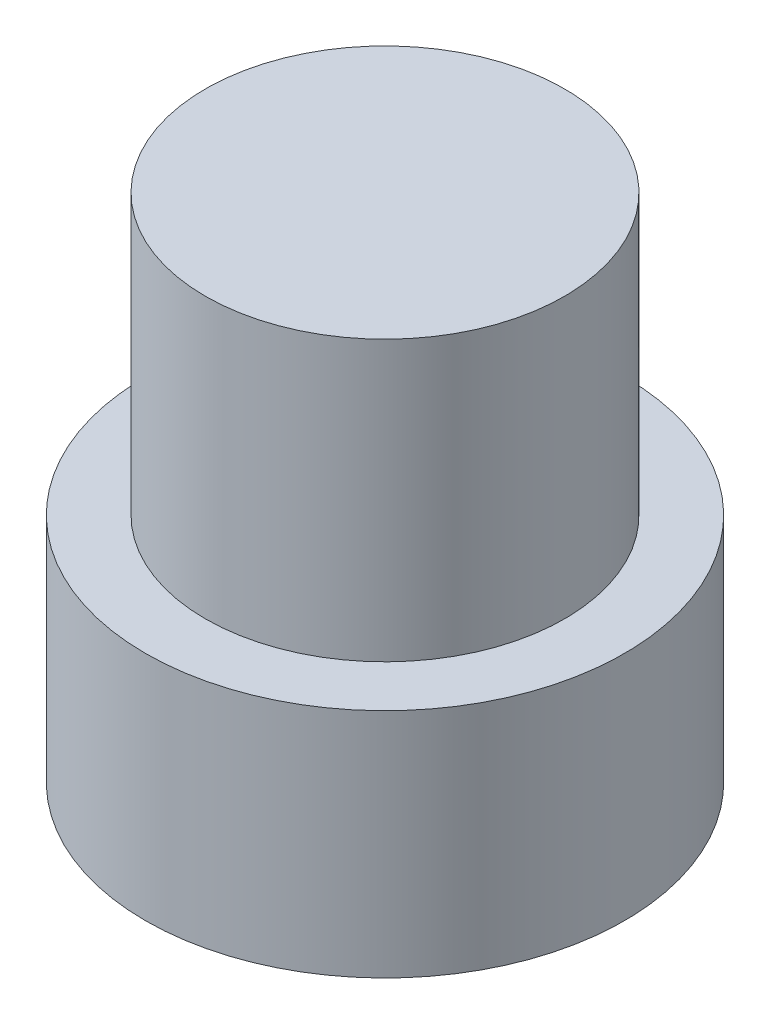
ISO-10303-21;
HEADER;
FILE_DESCRIPTION(('STEP AP214'),'2;1');
FILE_NAME('part.step','',(''),(''),'','','');
FILE_SCHEMA(('AUTOMOTIVE_DESIGN { 1 0 10303 214 1 1 1 1 }'));
ENDSEC;
DATA;
#1=APPLICATION_CONTEXT('core data for automotive mechanical design processes');
#2=APPLICATION_PROTOCOL_DEFINITION('international standard','automotive_design',2000,#1);
#3=PRODUCT_CONTEXT('',#1,'mechanical');
#4=PRODUCT('Part','Part','',(#3));
#5=PRODUCT_RELATED_PRODUCT_CATEGORY('part','',(#4));
#6=PRODUCT_DEFINITION_FORMATION('','',#4);
#7=PRODUCT_DEFINITION_CONTEXT('part definition',#1,'design');
#8=PRODUCT_DEFINITION('design','',#6,#7);
#9=PRODUCT_DEFINITION_SHAPE('','',#8);
#10=(LENGTH_UNIT() NAMED_UNIT(*) SI_UNIT(.MILLI.,.METRE.));
#11=(NAMED_UNIT(*) PLANE_ANGLE_UNIT() SI_UNIT($,.RADIAN.));
#12=(NAMED_UNIT(*) SI_UNIT($,.STERADIAN.) SOLID_ANGLE_UNIT());
#13=UNCERTAINTY_MEASURE_WITH_UNIT(LENGTH_MEASURE(1.E-05),#10,'distance_accuracy_value','');
#14=(GEOMETRIC_REPRESENTATION_CONTEXT(3) GLOBAL_UNCERTAINTY_ASSIGNED_CONTEXT((#13)) GLOBAL_UNIT_ASSIGNED_CONTEXT((#10,
#11,#12)) REPRESENTATION_CONTEXT('',''));
#15=CARTESIAN_POINT('',(0.,0.,0.));
#16=DIRECTION('',(0.,0.,1.));
#17=DIRECTION('',(1.,0.,0.));
#18=AXIS2_PLACEMENT_3D('',#15,#16,#17);
#19=CARTESIAN_POINT('',(0.,-5.8,0.));
#20=DIRECTION('',(0.,1.,0.));
#21=DIRECTION('',(0.,0.,1.));
#22=AXIS2_PLACEMENT_3D('',#19,#20,#21);
#23=PLANE('',#22);
#24=CARTESIAN_POINT('',(0.,-5.8,0.));
#25=DIRECTION('',(0.,1.,0.));
#26=DIRECTION('',(0.,0.,1.));
#27=AXIS2_PLACEMENT_3D('',#24,#25,#26);
#28=CIRCLE('',#27,6.);
#29=CARTESIAN_POINT('',(0.,-5.8,6.));
#30=VERTEX_POINT('',#29);
#31=EDGE_CURVE('E36',#30,#30,#28,.T.);
#32=ORIENTED_EDGE('',*,*,#31,.F.);
#33=EDGE_LOOP('',(#32));
#34=FACE_BOUND('',#33,.T.);
#35=CARTESIAN_POINT('',(0.,-5.8,0.));
#36=DIRECTION('',(0.,1.,0.));
#37=DIRECTION('',(0.,0.,1.));
#38=AXIS2_PLACEMENT_3D('',#35,#36,#37);
#39=CIRCLE('',#38,2.5);
#40=CARTESIAN_POINT('',(0.,-5.8,2.5));
#41=VERTEX_POINT('',#40);
#42=EDGE_CURVE('E10',#41,#41,#39,.F.);
#43=ORIENTED_EDGE('',*,*,#42,.F.);
#44=EDGE_LOOP('',(#43));
#45=FACE_BOUND('',#44,.T.);
#46=ADVANCED_FACE('F29',(#34,#45),#23,.F.);
#47=CARTESIAN_POINT('',(0.,0.,0.));
#48=DIRECTION('',(0.,1.,0.));
#49=DIRECTION('',(0.,0.,1.));
#50=AXIS2_PLACEMENT_3D('',#47,#48,#49);
#51=PLANE('',#50);
#52=CARTESIAN_POINT('',(0.,0.,0.));
#53=DIRECTION('',(0.,1.,0.));
#54=DIRECTION('',(0.,0.,1.));
#55=AXIS2_PLACEMENT_3D('',#52,#53,#54);
#56=CIRCLE('',#55,6.);
#57=CARTESIAN_POINT('',(0.,0.,6.));
#58=VERTEX_POINT('',#57);
#59=EDGE_CURVE('E40',#58,#58,#56,.T.);
#60=ORIENTED_EDGE('',*,*,#59,.T.);
#61=EDGE_LOOP('',(#60));
#62=FACE_BOUND('',#61,.T.);
#63=CARTESIAN_POINT('',(0.,0.,0.));
#64=DIRECTION('',(0.,1.,0.));
#65=DIRECTION('',(0.,0.,1.));
#66=AXIS2_PLACEMENT_3D('',#63,#64,#65);
#67=CIRCLE('',#66,4.5);
#68=CARTESIAN_POINT('',(0.,0.,4.5));
#69=VERTEX_POINT('',#68);
#70=EDGE_CURVE('E47',#69,#69,#67,.T.);
#71=ORIENTED_EDGE('',*,*,#70,.F.);
#72=EDGE_LOOP('',(#71));
#73=FACE_BOUND('',#72,.T.);
#74=ADVANCED_FACE('F71',(#62,#73),#51,.T.);
#75=CARTESIAN_POINT('',(0.,-5.8,0.));
#76=DIRECTION('',(0.,1.,0.));
#77=DIRECTION('',(0.,0.,1.));
#78=AXIS2_PLACEMENT_3D('',#75,#76,#77);
#79=CYLINDRICAL_SURFACE('',#78,6.);
#80=ORIENTED_EDGE('',*,*,#31,.T.);
#81=EDGE_LOOP('',(#80));
#82=FACE_BOUND('',#81,.T.);
#83=ORIENTED_EDGE('',*,*,#59,.F.);
#84=EDGE_LOOP('',(#83));
#85=FACE_BOUND('',#84,.T.);
#86=ADVANCED_FACE('F31',(#82,#85),#79,.T.);
#87=CARTESIAN_POINT('',(0.,7.,0.));
#88=DIRECTION('',(0.,-1.,0.));
#89=DIRECTION('',(0.,0.,-1.));
#90=AXIS2_PLACEMENT_3D('',#87,#88,#89);
#91=CYLINDRICAL_SURFACE('',#90,4.5);
#92=CARTESIAN_POINT('',(0.,7.,0.));
#93=DIRECTION('',(0.,1.,0.));
#94=DIRECTION('',(0.,0.,1.));
#95=AXIS2_PLACEMENT_3D('',#92,#93,#94);
#96=CIRCLE('',#95,4.5);
#97=CARTESIAN_POINT('',(0.,7.,4.5));
#98=VERTEX_POINT('',#97);
#99=EDGE_CURVE('E45',#98,#98,#96,.T.);
#100=ORIENTED_EDGE('',*,*,#99,.F.);
#101=EDGE_LOOP('',(#100));
#102=FACE_BOUND('',#101,.T.);
#103=ORIENTED_EDGE('',*,*,#70,.T.);
#104=EDGE_LOOP('',(#103));
#105=FACE_BOUND('',#104,.T.);
#106=ADVANCED_FACE('F67',(#102,#105),#91,.T.);
#107=CARTESIAN_POINT('',(0.,7.,0.));
#108=DIRECTION('',(0.,1.,0.));
#109=DIRECTION('',(0.,0.,1.));
#110=AXIS2_PLACEMENT_3D('',#107,#108,#109);
#111=PLANE('',#110);
#112=ORIENTED_EDGE('',*,*,#99,.T.);
#113=EDGE_LOOP('',(#112));
#114=FACE_BOUND('',#113,.T.);
#115=ADVANCED_FACE('F60',(#114),#111,.T.);
#116=CARTESIAN_POINT('',(0.,-7.3,0.));
#117=DIRECTION('',(0.,1.,0.));
#118=DIRECTION('',(0.,0.,1.));
#119=AXIS2_PLACEMENT_3D('',#116,#117,#118);
#120=CYLINDRICAL_SURFACE('',#119,2.5);
#121=CARTESIAN_POINT('',(0.,-7.3,0.));
#122=DIRECTION('',(0.,-1.,0.));
#123=DIRECTION('',(0.,0.,-1.));
#124=AXIS2_PLACEMENT_3D('',#121,#122,#123);
#125=CIRCLE('',#124,2.5);
#126=CARTESIAN_POINT('',(0.,-7.3,-2.5));
#127=VERTEX_POINT('',#126);
#128=EDGE_CURVE('E50',#127,#127,#125,.T.);
#129=ORIENTED_EDGE('',*,*,#128,.F.);
#130=EDGE_LOOP('',(#129));
#131=FACE_BOUND('',#130,.T.);
#132=ORIENTED_EDGE('',*,*,#42,.T.);
#133=EDGE_LOOP('',(#132));
#134=FACE_BOUND('',#133,.T.);
#135=ADVANCED_FACE('F58',(#131,#134),#120,.T.);
#136=CARTESIAN_POINT('',(0.,-7.3,0.));
#137=DIRECTION('',(0.,-1.,0.));
#138=DIRECTION('',(0.,0.,-1.));
#139=AXIS2_PLACEMENT_3D('',#136,#137,#138);
#140=PLANE('',#139);
#141=ORIENTED_EDGE('',*,*,#128,.T.);
#142=EDGE_LOOP('',(#141));
#143=FACE_BOUND('',#142,.T.);
#144=ADVANCED_FACE('F56',(#143),#140,.T.);
#145=CLOSED_SHELL('',(#46,#74,#86,#106,#115,#135,#144));
#146=MANIFOLD_SOLID_BREP('B2',#145);
#147=ADVANCED_BREP_SHAPE_REPRESENTATION('',(#18,#146),#14);
#148=SHAPE_DEFINITION_REPRESENTATION(#9,#147);
ENDSEC;
END-ISO-10303-21;
